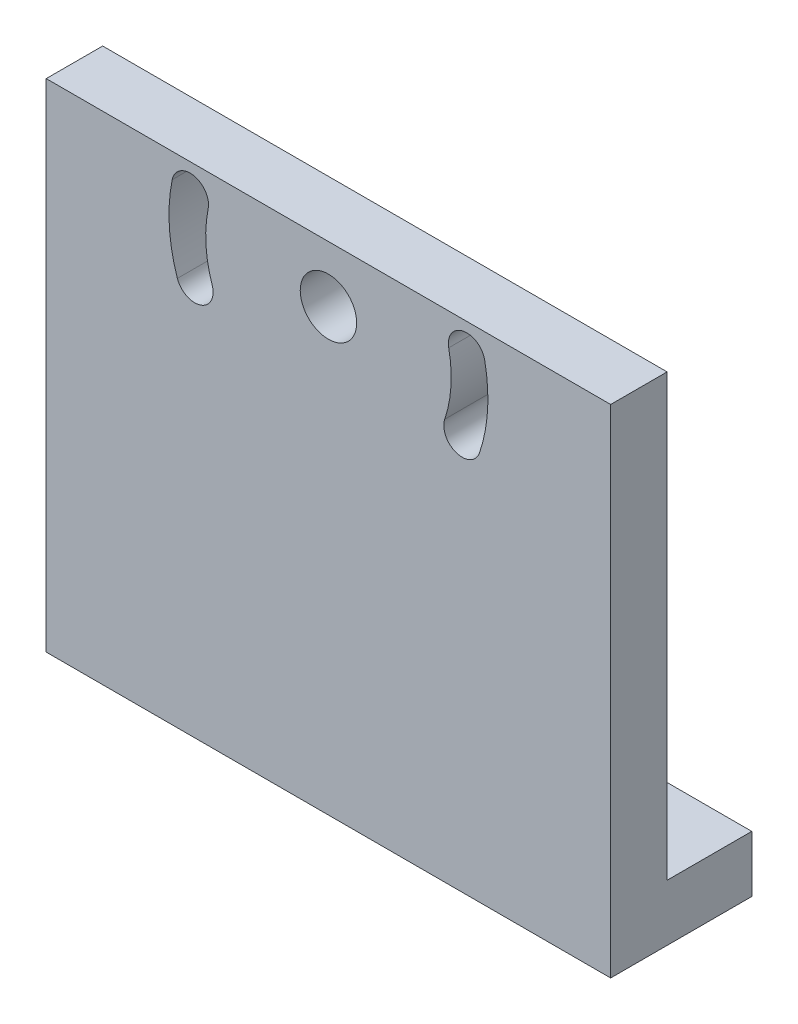
ISO-10303-21;
HEADER;
FILE_DESCRIPTION(('STEP AP214'),'2;1');
FILE_NAME('part.step','',(''),(''),'','','');
FILE_SCHEMA(('AUTOMOTIVE_DESIGN { 1 0 10303 214 1 1 1 1 }'));
ENDSEC;
DATA;
#1=APPLICATION_CONTEXT('core data for automotive mechanical design processes');
#2=APPLICATION_PROTOCOL_DEFINITION('international standard','automotive_design',2000,#1);
#3=PRODUCT_CONTEXT('',#1,'mechanical');
#4=PRODUCT('Part','Part','',(#3));
#5=PRODUCT_RELATED_PRODUCT_CATEGORY('part','',(#4));
#6=PRODUCT_DEFINITION_FORMATION('','',#4);
#7=PRODUCT_DEFINITION_CONTEXT('part definition',#1,'design');
#8=PRODUCT_DEFINITION('design','',#6,#7);
#9=PRODUCT_DEFINITION_SHAPE('','',#8);
#10=(LENGTH_UNIT() NAMED_UNIT(*) SI_UNIT(.MILLI.,.METRE.));
#11=(NAMED_UNIT(*) PLANE_ANGLE_UNIT() SI_UNIT($,.RADIAN.));
#12=(NAMED_UNIT(*) SI_UNIT($,.STERADIAN.) SOLID_ANGLE_UNIT());
#13=UNCERTAINTY_MEASURE_WITH_UNIT(LENGTH_MEASURE(1.E-05),#10,'distance_accuracy_value','');
#14=(GEOMETRIC_REPRESENTATION_CONTEXT(3) GLOBAL_UNCERTAINTY_ASSIGNED_CONTEXT((#13)) GLOBAL_UNIT_ASSIGNED_CONTEXT((#10,
#11,#12)) REPRESENTATION_CONTEXT('',''));
#15=CARTESIAN_POINT('',(0.,0.,0.));
#16=DIRECTION('',(0.,0.,1.));
#17=DIRECTION('',(1.,0.,0.));
#18=AXIS2_PLACEMENT_3D('',#15,#16,#17);
#19=CARTESIAN_POINT('',(0.,0.,0.));
#20=DIRECTION('',(0.,0.,-1.));
#21=DIRECTION('',(-1.,0.,0.));
#22=AXIS2_PLACEMENT_3D('',#19,#20,#21);
#23=PLANE('',#22);
#24=CARTESIAN_POINT('',(26.314561435346,25.,0.));
#25=DIRECTION('',(0.,0.,1.));
#26=DIRECTION('',(1.,0.,0.));
#27=AXIS2_PLACEMENT_3D('',#24,#25,#26);
#28=CIRCLE('',#27,3.25);
#29=CARTESIAN_POINT('',(23.235454421941,23.96,0.));
#30=VERTEX_POINT('',#29);
#31=CARTESIAN_POINT('',(29.393668448751,26.04,0.));
#32=VERTEX_POINT('',#31);
#33=EDGE_CURVE('E190',#30,#32,#28,.T.);
#34=ORIENTED_EDGE('',*,*,#33,.T.);
#35=CARTESIAN_POINT('',(50.,33.,0.));
#36=DIRECTION('',(0.,0.,-1.));
#37=DIRECTION('',(1.,0.,0.));
#38=AXIS2_PLACEMENT_3D('',#35,#36,#37);
#39=CIRCLE('',#38,21.75);
#40=CARTESIAN_POINT('',(28.6894392377864,37.35,0.));
#41=VERTEX_POINT('',#40);
#42=EDGE_CURVE('E176',#32,#41,#39,.T.);
#43=ORIENTED_EDGE('',*,*,#42,.T.);
#44=CARTESIAN_POINT('',(25.5051025721682,38.,0.));
#45=DIRECTION('',(0.,0.,1.));
#46=DIRECTION('',(1.,0.,0.));
#47=AXIS2_PLACEMENT_3D('',#44,#45,#46);
#48=CIRCLE('',#47,3.25000000000001);
#49=CARTESIAN_POINT('',(22.3207659065501,38.65,0.));
#50=VERTEX_POINT('',#49);
#51=EDGE_CURVE('E180',#41,#50,#48,.T.);
#52=ORIENTED_EDGE('',*,*,#51,.T.);
#53=CARTESIAN_POINT('',(50.,33.,0.));
#54=DIRECTION('',(0.,0.,1.));
#55=DIRECTION('',(1.,0.,0.));
#56=AXIS2_PLACEMENT_3D('',#53,#54,#55);
#57=CIRCLE('',#56,28.25);
#58=EDGE_CURVE('E193',#50,#30,#57,.T.);
#59=ORIENTED_EDGE('',*,*,#58,.T.);
#60=EDGE_LOOP('',(#34,#43,#52,#59));
#61=FACE_BOUND('',#60,.T.);
#62=CARTESIAN_POINT('',(50.,33.,0.));
#63=DIRECTION('',(0.,0.,1.));
#64=DIRECTION('',(-1.,0.,0.));
#65=AXIS2_PLACEMENT_3D('',#62,#63,#64);
#66=CIRCLE('',#65,21.75);
#67=CARTESIAN_POINT('',(70.606331551249,26.04,0.));
#68=VERTEX_POINT('',#67);
#69=CARTESIAN_POINT('',(71.3105607622137,37.35,0.));
#70=VERTEX_POINT('',#69);
#71=EDGE_CURVE('E201',#68,#70,#66,.T.);
#72=ORIENTED_EDGE('',*,*,#71,.F.);
#73=CARTESIAN_POINT('',(73.685438564654,25.,0.));
#74=DIRECTION('',(0.,0.,-1.));
#75=DIRECTION('',(-1.,0.,0.));
#76=AXIS2_PLACEMENT_3D('',#73,#74,#75);
#77=CIRCLE('',#76,3.25);
#78=CARTESIAN_POINT('',(76.7645455780591,23.96,0.));
#79=VERTEX_POINT('',#78);
#80=EDGE_CURVE('E212',#79,#68,#77,.T.);
#81=ORIENTED_EDGE('',*,*,#80,.F.);
#82=CARTESIAN_POINT('',(50.,33.,0.));
#83=DIRECTION('',(0.,0.,-1.));
#84=DIRECTION('',(-1.,0.,0.));
#85=AXIS2_PLACEMENT_3D('',#82,#83,#84);
#86=CIRCLE('',#85,28.25);
#87=CARTESIAN_POINT('',(77.6792340934499,38.65,0.));
#88=VERTEX_POINT('',#87);
#89=EDGE_CURVE('E226',#88,#79,#86,.T.);
#90=ORIENTED_EDGE('',*,*,#89,.F.);
#91=CARTESIAN_POINT('',(74.4948974278318,38.,0.));
#92=DIRECTION('',(0.,0.,-1.));
#93=DIRECTION('',(-1.,0.,0.));
#94=AXIS2_PLACEMENT_3D('',#91,#92,#93);
#95=CIRCLE('',#94,3.25000000000001);
#96=EDGE_CURVE('E223',#70,#88,#95,.T.);
#97=ORIENTED_EDGE('',*,*,#96,.F.);
#98=EDGE_LOOP('',(#72,#81,#90,#97));
#99=FACE_BOUND('',#98,.T.);
#100=CARTESIAN_POINT('',(50.,33.,0.));
#101=DIRECTION('',(0.,0.,-1.));
#102=DIRECTION('',(-1.,0.,0.));
#103=AXIS2_PLACEMENT_3D('',#100,#101,#102);
#104=CIRCLE('',#103,5.);
#105=CARTESIAN_POINT('',(45.,33.,0.));
#106=VERTEX_POINT('',#105);
#107=EDGE_CURVE('E233',#106,#106,#104,.T.);
#108=ORIENTED_EDGE('',*,*,#107,.F.);
#109=EDGE_LOOP('',(#108));
#110=FACE_BOUND('',#109,.T.);
#111=DIRECTION('',(0.,-1.,0.));
#112=VECTOR('',#111,1.);
#113=CARTESIAN_POINT('',(100.,103.,0.));
#114=LINE('',#113,#112);
#115=CARTESIAN_POINT('',(100.,43.,0.));
#116=VERTEX_POINT('',#115);
#117=CARTESIAN_POINT('',(100.,-35.,0.));
#118=VERTEX_POINT('',#117);
#119=EDGE_CURVE('E55',#116,#118,#114,.T.);
#120=ORIENTED_EDGE('',*,*,#119,.T.);
#121=DIRECTION('',(1.,0.,0.));
#122=VECTOR('',#121,1.);
#123=CARTESIAN_POINT('',(100.,-35.,0.));
#124=LINE('',#123,#122);
#125=CARTESIAN_POINT('',(0.,-35.,0.));
#126=VERTEX_POINT('',#125);
#127=EDGE_CURVE('E50',#126,#118,#124,.T.);
#128=ORIENTED_EDGE('',*,*,#127,.F.);
#129=DIRECTION('',(0.,-1.,0.));
#130=VECTOR('',#129,1.);
#131=CARTESIAN_POINT('',(0.,0.,0.));
#132=LINE('',#131,#130);
#133=CARTESIAN_POINT('',(0.,43.,0.));
#134=VERTEX_POINT('',#133);
#135=EDGE_CURVE('E253',#134,#126,#132,.T.);
#136=ORIENTED_EDGE('',*,*,#135,.F.);
#137=DIRECTION('',(1.,0.,0.));
#138=VECTOR('',#137,1.);
#139=CARTESIAN_POINT('',(0.,43.,0.));
#140=LINE('',#139,#138);
#141=EDGE_CURVE('E246',#134,#116,#140,.T.);
#142=ORIENTED_EDGE('',*,*,#141,.T.);
#143=EDGE_LOOP('',(#120,#128,#136,#142));
#144=FACE_BOUND('',#143,.T.);
#145=ADVANCED_FACE('F35',(#61,#99,#110,#144),#23,.T.);
#146=CARTESIAN_POINT('',(0.,0.,10.));
#147=DIRECTION('',(1.,0.,0.));
#148=DIRECTION('',(0.,0.,-1.));
#149=AXIS2_PLACEMENT_3D('',#146,#147,#148);
#150=PLANE('',#149);
#151=ORIENTED_EDGE('',*,*,#135,.T.);
#152=DIRECTION('',(0.,0.,1.));
#153=VECTOR('',#152,1.);
#154=CARTESIAN_POINT('',(0.,-35.,-15.));
#155=LINE('',#154,#153);
#156=CARTESIAN_POINT('',(0.,-35.,-15.));
#157=VERTEX_POINT('',#156);
#158=EDGE_CURVE('E156',#157,#126,#155,.T.);
#159=ORIENTED_EDGE('',*,*,#158,.F.);
#160=DIRECTION('',(0.,-1.,0.));
#161=VECTOR('',#160,1.);
#162=CARTESIAN_POINT('',(0.,-45.,-15.));
#163=LINE('',#162,#161);
#164=CARTESIAN_POINT('',(0.,-45.,-15.));
#165=VERTEX_POINT('',#164);
#166=EDGE_CURVE('E152',#157,#165,#163,.T.);
#167=ORIENTED_EDGE('',*,*,#166,.T.);
#168=DIRECTION('',(0.,0.,-1.));
#169=VECTOR('',#168,1.);
#170=CARTESIAN_POINT('',(0.,-45.,0.));
#171=LINE('',#170,#169);
#172=CARTESIAN_POINT('',(0.,-45.,10.));
#173=VERTEX_POINT('',#172);
#174=EDGE_CURVE('E174',#173,#165,#171,.T.);
#175=ORIENTED_EDGE('',*,*,#174,.F.);
#176=DIRECTION('',(0.,-1.,0.));
#177=VECTOR('',#176,1.);
#178=CARTESIAN_POINT('',(0.,0.,10.));
#179=LINE('',#178,#177);
#180=CARTESIAN_POINT('',(0.,43.,10.));
#181=VERTEX_POINT('',#180);
#182=EDGE_CURVE('E43',#181,#173,#179,.T.);
#183=ORIENTED_EDGE('',*,*,#182,.F.);
#184=DIRECTION('',(0.,0.,1.));
#185=VECTOR('',#184,1.);
#186=CARTESIAN_POINT('',(0.,43.,0.));
#187=LINE('',#186,#185);
#188=EDGE_CURVE('E248',#134,#181,#187,.T.);
#189=ORIENTED_EDGE('',*,*,#188,.F.);
#190=EDGE_LOOP('',(#151,#159,#167,#175,#183,#189));
#191=FACE_BOUND('',#190,.T.);
#192=ADVANCED_FACE('F37',(#191),#150,.F.);
#193=CARTESIAN_POINT('',(0.,0.,10.));
#194=DIRECTION('',(0.,0.,-1.));
#195=DIRECTION('',(-1.,0.,0.));
#196=AXIS2_PLACEMENT_3D('',#193,#194,#195);
#197=PLANE('',#196);
#198=CARTESIAN_POINT('',(50.,33.,10.));
#199=DIRECTION('',(0.,0.,-1.));
#200=DIRECTION('',(1.,0.,0.));
#201=AXIS2_PLACEMENT_3D('',#198,#199,#200);
#202=CIRCLE('',#201,21.75);
#203=CARTESIAN_POINT('',(29.393668448751,26.04,10.));
#204=VERTEX_POINT('',#203);
#205=CARTESIAN_POINT('',(28.6894392377864,37.35,10.));
#206=VERTEX_POINT('',#205);
#207=EDGE_CURVE('E177',#204,#206,#202,.T.);
#208=ORIENTED_EDGE('',*,*,#207,.F.);
#209=CARTESIAN_POINT('',(26.314561435346,25.,10.));
#210=DIRECTION('',(0.,0.,1.));
#211=DIRECTION('',(1.,0.,0.));
#212=AXIS2_PLACEMENT_3D('',#209,#210,#211);
#213=CIRCLE('',#212,3.25);
#214=CARTESIAN_POINT('',(23.235454421941,23.96,10.));
#215=VERTEX_POINT('',#214);
#216=EDGE_CURVE('E179',#215,#204,#213,.T.);
#217=ORIENTED_EDGE('',*,*,#216,.F.);
#218=CARTESIAN_POINT('',(50.,33.,10.));
#219=DIRECTION('',(0.,0.,1.));
#220=DIRECTION('',(1.,0.,0.));
#221=AXIS2_PLACEMENT_3D('',#218,#219,#220);
#222=CIRCLE('',#221,28.25);
#223=CARTESIAN_POINT('',(22.3207659065501,38.65,10.));
#224=VERTEX_POINT('',#223);
#225=EDGE_CURVE('E182',#224,#215,#222,.T.);
#226=ORIENTED_EDGE('',*,*,#225,.F.);
#227=CARTESIAN_POINT('',(25.5051025721682,38.,10.));
#228=DIRECTION('',(0.,0.,1.));
#229=DIRECTION('',(1.,0.,0.));
#230=AXIS2_PLACEMENT_3D('',#227,#228,#229);
#231=CIRCLE('',#230,3.25000000000001);
#232=EDGE_CURVE('E185',#206,#224,#231,.T.);
#233=ORIENTED_EDGE('',*,*,#232,.F.);
#234=EDGE_LOOP('',(#208,#217,#226,#233));
#235=FACE_BOUND('',#234,.T.);
#236=CARTESIAN_POINT('',(73.685438564654,25.,10.));
#237=DIRECTION('',(0.,0.,-1.));
#238=DIRECTION('',(-1.,0.,0.));
#239=AXIS2_PLACEMENT_3D('',#236,#237,#238);
#240=CIRCLE('',#239,3.25);
#241=CARTESIAN_POINT('',(76.7645455780591,23.96,10.));
#242=VERTEX_POINT('',#241);
#243=CARTESIAN_POINT('',(70.606331551249,26.04,10.));
#244=VERTEX_POINT('',#243);
#245=EDGE_CURVE('E218',#242,#244,#240,.T.);
#246=ORIENTED_EDGE('',*,*,#245,.T.);
#247=CARTESIAN_POINT('',(50.,33.,10.));
#248=DIRECTION('',(0.,0.,1.));
#249=DIRECTION('',(-1.,0.,0.));
#250=AXIS2_PLACEMENT_3D('',#247,#248,#249);
#251=CIRCLE('',#250,21.75);
#252=CARTESIAN_POINT('',(71.3105607622137,37.35,10.));
#253=VERTEX_POINT('',#252);
#254=EDGE_CURVE('E208',#244,#253,#251,.T.);
#255=ORIENTED_EDGE('',*,*,#254,.T.);
#256=CARTESIAN_POINT('',(74.4948974278318,38.,10.));
#257=DIRECTION('',(0.,0.,-1.));
#258=DIRECTION('',(-1.,0.,0.));
#259=AXIS2_PLACEMENT_3D('',#256,#257,#258);
#260=CIRCLE('',#259,3.25000000000001);
#261=CARTESIAN_POINT('',(77.6792340934499,38.65,10.));
#262=VERTEX_POINT('',#261);
#263=EDGE_CURVE('E211',#253,#262,#260,.T.);
#264=ORIENTED_EDGE('',*,*,#263,.T.);
#265=CARTESIAN_POINT('',(50.,33.,10.));
#266=DIRECTION('',(0.,0.,-1.));
#267=DIRECTION('',(-1.,0.,0.));
#268=AXIS2_PLACEMENT_3D('',#265,#266,#267);
#269=CIRCLE('',#268,28.25);
#270=EDGE_CURVE('E215',#262,#242,#269,.T.);
#271=ORIENTED_EDGE('',*,*,#270,.T.);
#272=EDGE_LOOP('',(#246,#255,#264,#271));
#273=FACE_BOUND('',#272,.T.);
#274=CARTESIAN_POINT('',(50.,33.,10.));
#275=DIRECTION('',(0.,0.,-1.));
#276=DIRECTION('',(-1.,0.,0.));
#277=AXIS2_PLACEMENT_3D('',#274,#275,#276);
#278=CIRCLE('',#277,5.);
#279=CARTESIAN_POINT('',(45.,33.,10.));
#280=VERTEX_POINT('',#279);
#281=EDGE_CURVE('E240',#280,#280,#278,.T.);
#282=ORIENTED_EDGE('',*,*,#281,.T.);
#283=EDGE_LOOP('',(#282));
#284=FACE_BOUND('',#283,.T.);
#285=ORIENTED_EDGE('',*,*,#182,.T.);
#286=DIRECTION('',(-1.,0.,0.));
#287=VECTOR('',#286,1.);
#288=CARTESIAN_POINT('',(100.,-45.,10.));
#289=LINE('',#288,#287);
#290=CARTESIAN_POINT('',(100.,-45.,10.));
#291=VERTEX_POINT('',#290);
#292=EDGE_CURVE('E171',#291,#173,#289,.T.);
#293=ORIENTED_EDGE('',*,*,#292,.F.);
#294=DIRECTION('',(0.,-1.,0.));
#295=VECTOR('',#294,1.);
#296=CARTESIAN_POINT('',(100.,103.,10.));
#297=LINE('',#296,#295);
#298=CARTESIAN_POINT('',(100.,43.,10.));
#299=VERTEX_POINT('',#298);
#300=EDGE_CURVE('E251',#299,#291,#297,.T.);
#301=ORIENTED_EDGE('',*,*,#300,.F.);
#302=DIRECTION('',(1.,0.,0.));
#303=VECTOR('',#302,1.);
#304=CARTESIAN_POINT('',(0.,43.,10.));
#305=LINE('',#304,#303);
#306=EDGE_CURVE('E243',#181,#299,#305,.T.);
#307=ORIENTED_EDGE('',*,*,#306,.F.);
#308=EDGE_LOOP('',(#285,#293,#301,#307));
#309=FACE_BOUND('',#308,.T.);
#310=ADVANCED_FACE('F263',(#235,#273,#284,#309),#197,.F.);
#311=CARTESIAN_POINT('',(100.,103.,0.));
#312=DIRECTION('',(-1.,0.,0.));
#313=DIRECTION('',(0.,-1.,0.));
#314=AXIS2_PLACEMENT_3D('',#311,#312,#313);
#315=PLANE('',#314);
#316=ORIENTED_EDGE('',*,*,#300,.T.);
#317=DIRECTION('',(0.,0.,1.));
#318=VECTOR('',#317,1.);
#319=CARTESIAN_POINT('',(100.,-45.,0.));
#320=LINE('',#319,#318);
#321=CARTESIAN_POINT('',(100.,-45.,-15.));
#322=VERTEX_POINT('',#321);
#323=EDGE_CURVE('E142',#322,#291,#320,.T.);
#324=ORIENTED_EDGE('',*,*,#323,.F.);
#325=DIRECTION('',(0.,1.,0.));
#326=VECTOR('',#325,1.);
#327=CARTESIAN_POINT('',(100.,-45.,-15.));
#328=LINE('',#327,#326);
#329=CARTESIAN_POINT('',(100.,-35.,-15.));
#330=VERTEX_POINT('',#329);
#331=EDGE_CURVE('E136',#322,#330,#328,.T.);
#332=ORIENTED_EDGE('',*,*,#331,.T.);
#333=DIRECTION('',(0.,0.,-1.));
#334=VECTOR('',#333,1.);
#335=CARTESIAN_POINT('',(100.,-35.,-15.));
#336=LINE('',#335,#334);
#337=EDGE_CURVE('E140',#118,#330,#336,.T.);
#338=ORIENTED_EDGE('',*,*,#337,.F.);
#339=ORIENTED_EDGE('',*,*,#119,.F.);
#340=DIRECTION('',(0.,0.,1.));
#341=VECTOR('',#340,1.);
#342=CARTESIAN_POINT('',(100.,43.,0.));
#343=LINE('',#342,#341);
#344=EDGE_CURVE('E11',#116,#299,#343,.T.);
#345=ORIENTED_EDGE('',*,*,#344,.T.);
#346=EDGE_LOOP('',(#316,#324,#332,#338,#339,#345));
#347=FACE_BOUND('',#346,.T.);
#348=ADVANCED_FACE('F138',(#347),#315,.F.);
#349=CARTESIAN_POINT('',(0.,43.,0.));
#350=DIRECTION('',(0.,-1.,0.));
#351=DIRECTION('',(0.,0.,-1.));
#352=AXIS2_PLACEMENT_3D('',#349,#350,#351);
#353=PLANE('',#352);
#354=ORIENTED_EDGE('',*,*,#141,.F.);
#355=ORIENTED_EDGE('',*,*,#188,.T.);
#356=ORIENTED_EDGE('',*,*,#306,.T.);
#357=ORIENTED_EDGE('',*,*,#344,.F.);
#358=EDGE_LOOP('',(#354,#355,#356,#357));
#359=FACE_BOUND('',#358,.T.);
#360=ADVANCED_FACE('F298',(#359),#353,.F.);
#361=CARTESIAN_POINT('',(50.,33.,10.));
#362=DIRECTION('',(0.,0.,-1.));
#363=DIRECTION('',(-1.,0.,0.));
#364=AXIS2_PLACEMENT_3D('',#361,#362,#363);
#365=CYLINDRICAL_SURFACE('',#364,5.);
#366=ORIENTED_EDGE('',*,*,#281,.F.);
#367=EDGE_LOOP('',(#366));
#368=FACE_BOUND('',#367,.T.);
#369=ORIENTED_EDGE('',*,*,#107,.T.);
#370=EDGE_LOOP('',(#369));
#371=FACE_BOUND('',#370,.T.);
#372=ADVANCED_FACE('F301',(#368,#371),#365,.F.);
#373=CARTESIAN_POINT('',(50.,33.,10.));
#374=DIRECTION('',(0.,0.,-1.));
#375=DIRECTION('',(-1.,0.,0.));
#376=AXIS2_PLACEMENT_3D('',#373,#374,#375);
#377=CYLINDRICAL_SURFACE('',#376,21.75);
#378=ORIENTED_EDGE('',*,*,#71,.T.);
#379=DIRECTION('',(0.,0.,-1.));
#380=VECTOR('',#379,1.);
#381=CARTESIAN_POINT('',(71.3105607622137,37.35,10.));
#382=LINE('',#381,#380);
#383=EDGE_CURVE('E221',#253,#70,#382,.T.);
#384=ORIENTED_EDGE('',*,*,#383,.F.);
#385=ORIENTED_EDGE('',*,*,#254,.F.);
#386=DIRECTION('',(0.,0.,-1.));
#387=VECTOR('',#386,1.);
#388=CARTESIAN_POINT('',(70.606331551249,26.04,10.));
#389=LINE('',#388,#387);
#390=EDGE_CURVE('E231',#244,#68,#389,.T.);
#391=ORIENTED_EDGE('',*,*,#390,.T.);
#392=EDGE_LOOP('',(#378,#384,#385,#391));
#393=FACE_BOUND('',#392,.T.);
#394=ADVANCED_FACE('F304',(#393),#377,.T.);
#395=CARTESIAN_POINT('',(73.685438564654,25.,10.));
#396=DIRECTION('',(0.,0.,-1.));
#397=DIRECTION('',(-1.,0.,0.));
#398=AXIS2_PLACEMENT_3D('',#395,#396,#397);
#399=CYLINDRICAL_SURFACE('',#398,3.25);
#400=ORIENTED_EDGE('',*,*,#80,.T.);
#401=ORIENTED_EDGE('',*,*,#390,.F.);
#402=ORIENTED_EDGE('',*,*,#245,.F.);
#403=DIRECTION('',(0.,0.,-1.));
#404=VECTOR('',#403,1.);
#405=CARTESIAN_POINT('',(76.7645455780591,23.96,10.));
#406=LINE('',#405,#404);
#407=EDGE_CURVE('E234',#242,#79,#406,.T.);
#408=ORIENTED_EDGE('',*,*,#407,.T.);
#409=EDGE_LOOP('',(#400,#401,#402,#408));
#410=FACE_BOUND('',#409,.T.);
#411=ADVANCED_FACE('F308',(#410),#399,.F.);
#412=CARTESIAN_POINT('',(50.,33.,10.));
#413=DIRECTION('',(0.,0.,-1.));
#414=DIRECTION('',(-1.,0.,0.));
#415=AXIS2_PLACEMENT_3D('',#412,#413,#414);
#416=CYLINDRICAL_SURFACE('',#415,28.25);
#417=ORIENTED_EDGE('',*,*,#89,.T.);
#418=ORIENTED_EDGE('',*,*,#407,.F.);
#419=ORIENTED_EDGE('',*,*,#270,.F.);
#420=DIRECTION('',(0.,0.,-1.));
#421=VECTOR('',#420,1.);
#422=CARTESIAN_POINT('',(77.6792340934499,38.65,10.));
#423=LINE('',#422,#421);
#424=EDGE_CURVE('E236',#262,#88,#423,.T.);
#425=ORIENTED_EDGE('',*,*,#424,.T.);
#426=EDGE_LOOP('',(#417,#418,#419,#425));
#427=FACE_BOUND('',#426,.T.);
#428=ADVANCED_FACE('F314',(#427),#416,.F.);
#429=CARTESIAN_POINT('',(74.4948974278318,38.,10.));
#430=DIRECTION('',(0.,0.,-1.));
#431=DIRECTION('',(-1.,0.,0.));
#432=AXIS2_PLACEMENT_3D('',#429,#430,#431);
#433=CYLINDRICAL_SURFACE('',#432,3.25000000000001);
#434=ORIENTED_EDGE('',*,*,#96,.T.);
#435=ORIENTED_EDGE('',*,*,#424,.F.);
#436=ORIENTED_EDGE('',*,*,#263,.F.);
#437=ORIENTED_EDGE('',*,*,#383,.T.);
#438=EDGE_LOOP('',(#434,#435,#436,#437));
#439=FACE_BOUND('',#438,.T.);
#440=ADVANCED_FACE('F310',(#439),#433,.F.);
#441=CARTESIAN_POINT('',(50.,33.,10.));
#442=DIRECTION('',(0.,0.,-1.));
#443=DIRECTION('',(-1.,0.,0.));
#444=AXIS2_PLACEMENT_3D('',#441,#442,#443);
#445=CYLINDRICAL_SURFACE('',#444,21.75);
#446=ORIENTED_EDGE('',*,*,#42,.F.);
#447=DIRECTION('',(0.,0.,-1.));
#448=VECTOR('',#447,1.);
#449=CARTESIAN_POINT('',(29.393668448751,26.04,10.));
#450=LINE('',#449,#448);
#451=EDGE_CURVE('E187',#204,#32,#450,.T.);
#452=ORIENTED_EDGE('',*,*,#451,.F.);
#453=ORIENTED_EDGE('',*,*,#207,.T.);
#454=DIRECTION('',(0.,0.,-1.));
#455=VECTOR('',#454,1.);
#456=CARTESIAN_POINT('',(28.6894392377864,37.35,10.));
#457=LINE('',#456,#455);
#458=EDGE_CURVE('E198',#206,#41,#457,.T.);
#459=ORIENTED_EDGE('',*,*,#458,.T.);
#460=EDGE_LOOP('',(#446,#452,#453,#459));
#461=FACE_BOUND('',#460,.T.);
#462=ADVANCED_FACE('F313',(#461),#445,.T.);
#463=CARTESIAN_POINT('',(25.5051025721682,38.,10.));
#464=DIRECTION('',(0.,0.,-1.));
#465=DIRECTION('',(-1.,0.,0.));
#466=AXIS2_PLACEMENT_3D('',#463,#464,#465);
#467=CYLINDRICAL_SURFACE('',#466,3.25000000000001);
#468=ORIENTED_EDGE('',*,*,#51,.F.);
#469=ORIENTED_EDGE('',*,*,#458,.F.);
#470=ORIENTED_EDGE('',*,*,#232,.T.);
#471=DIRECTION('',(0.,0.,-1.));
#472=VECTOR('',#471,1.);
#473=CARTESIAN_POINT('',(22.3207659065501,38.65,10.));
#474=LINE('',#473,#472);
#475=EDGE_CURVE('E202',#224,#50,#474,.T.);
#476=ORIENTED_EDGE('',*,*,#475,.T.);
#477=EDGE_LOOP('',(#468,#469,#470,#476));
#478=FACE_BOUND('',#477,.T.);
#479=ADVANCED_FACE('F323',(#478),#467,.F.);
#480=CARTESIAN_POINT('',(50.,33.,10.));
#481=DIRECTION('',(0.,0.,-1.));
#482=DIRECTION('',(-1.,0.,0.));
#483=AXIS2_PLACEMENT_3D('',#480,#481,#482);
#484=CYLINDRICAL_SURFACE('',#483,28.25);
#485=ORIENTED_EDGE('',*,*,#58,.F.);
#486=ORIENTED_EDGE('',*,*,#475,.F.);
#487=ORIENTED_EDGE('',*,*,#225,.T.);
#488=DIRECTION('',(0.,0.,-1.));
#489=VECTOR('',#488,1.);
#490=CARTESIAN_POINT('',(23.235454421941,23.96,10.));
#491=LINE('',#490,#489);
#492=EDGE_CURVE('E204',#215,#30,#491,.T.);
#493=ORIENTED_EDGE('',*,*,#492,.T.);
#494=EDGE_LOOP('',(#485,#486,#487,#493));
#495=FACE_BOUND('',#494,.T.);
#496=ADVANCED_FACE('F278',(#495),#484,.F.);
#497=CARTESIAN_POINT('',(26.314561435346,25.,10.));
#498=DIRECTION('',(0.,0.,-1.));
#499=DIRECTION('',(-1.,0.,0.));
#500=AXIS2_PLACEMENT_3D('',#497,#498,#499);
#501=CYLINDRICAL_SURFACE('',#500,3.25);
#502=ORIENTED_EDGE('',*,*,#33,.F.);
#503=ORIENTED_EDGE('',*,*,#492,.F.);
#504=ORIENTED_EDGE('',*,*,#216,.T.);
#505=ORIENTED_EDGE('',*,*,#451,.T.);
#506=EDGE_LOOP('',(#502,#503,#504,#505));
#507=FACE_BOUND('',#506,.T.);
#508=ADVANCED_FACE('F268',(#507),#501,.F.);
#509=CARTESIAN_POINT('',(0.,-45.,0.));
#510=DIRECTION('',(0.,-1.,0.));
#511=DIRECTION('',(0.,0.,-1.));
#512=AXIS2_PLACEMENT_3D('',#509,#510,#511);
#513=PLANE('',#512);
#514=CARTESIAN_POINT('',(17.5,-45.,-6.88525049409349));
#515=DIRECTION('',(0.,1.,0.));
#516=DIRECTION('',(0.,0.,-1.));
#517=AXIS2_PLACEMENT_3D('',#514,#515,#516);
#518=CIRCLE('',#517,2.75000000000001);
#519=CARTESIAN_POINT('',(17.5,-45.,-9.6352504940935));
#520=VERTEX_POINT('',#519);
#521=EDGE_CURVE('E423',#520,#520,#518,.T.);
#522=ORIENTED_EDGE('',*,*,#521,.T.);
#523=EDGE_LOOP('',(#522));
#524=FACE_BOUND('',#523,.T.);
#525=CARTESIAN_POINT('',(82.5,-45.,-6.88525049409349));
#526=DIRECTION('',(0.,1.,0.));
#527=DIRECTION('',(0.,0.,1.));
#528=AXIS2_PLACEMENT_3D('',#525,#526,#527);
#529=CIRCLE('',#528,2.75000000000001);
#530=CARTESIAN_POINT('',(82.5,-45.,-4.13525049409349));
#531=VERTEX_POINT('',#530);
#532=EDGE_CURVE('E159',#531,#531,#529,.T.);
#533=ORIENTED_EDGE('',*,*,#532,.T.);
#534=EDGE_LOOP('',(#533));
#535=FACE_BOUND('',#534,.T.);
#536=ORIENTED_EDGE('',*,*,#323,.T.);
#537=ORIENTED_EDGE('',*,*,#292,.T.);
#538=ORIENTED_EDGE('',*,*,#174,.T.);
#539=DIRECTION('',(1.,0.,0.));
#540=VECTOR('',#539,1.);
#541=CARTESIAN_POINT('',(0.,-45.,-15.));
#542=LINE('',#541,#540);
#543=EDGE_CURVE('E146',#165,#322,#542,.T.);
#544=ORIENTED_EDGE('',*,*,#543,.T.);
#545=EDGE_LOOP('',(#536,#537,#538,#544));
#546=FACE_BOUND('',#545,.T.);
#547=ADVANCED_FACE('F266',(#524,#535,#546),#513,.T.);
#548=CARTESIAN_POINT('',(0.,0.,-15.));
#549=DIRECTION('',(0.,0.,-1.));
#550=DIRECTION('',(-1.,0.,0.));
#551=AXIS2_PLACEMENT_3D('',#548,#549,#550);
#552=PLANE('',#551);
#553=ORIENTED_EDGE('',*,*,#166,.F.);
#554=DIRECTION('',(-1.,0.,0.));
#555=VECTOR('',#554,1.);
#556=CARTESIAN_POINT('',(100.,-35.,-15.));
#557=LINE('',#556,#555);
#558=EDGE_CURVE('E149',#330,#157,#557,.T.);
#559=ORIENTED_EDGE('',*,*,#558,.F.);
#560=ORIENTED_EDGE('',*,*,#331,.F.);
#561=ORIENTED_EDGE('',*,*,#543,.F.);
#562=EDGE_LOOP('',(#553,#559,#560,#561));
#563=FACE_BOUND('',#562,.T.);
#564=ADVANCED_FACE('F150',(#563),#552,.T.);
#565=CARTESIAN_POINT('',(0.,-35.,0.));
#566=DIRECTION('',(0.,-1.,0.));
#567=DIRECTION('',(0.,0.,-1.));
#568=AXIS2_PLACEMENT_3D('',#565,#566,#567);
#569=PLANE('',#568);
#570=CARTESIAN_POINT('',(17.5,-35.,-6.88525049409349));
#571=DIRECTION('',(0.,1.,0.));
#572=DIRECTION('',(0.,0.,-1.));
#573=AXIS2_PLACEMENT_3D('',#570,#571,#572);
#574=CIRCLE('',#573,2.75000000000001);
#575=CARTESIAN_POINT('',(17.5,-35.,-9.6352504940935));
#576=VERTEX_POINT('',#575);
#577=EDGE_CURVE('E426',#576,#576,#574,.T.);
#578=ORIENTED_EDGE('',*,*,#577,.F.);
#579=EDGE_LOOP('',(#578));
#580=FACE_BOUND('',#579,.T.);
#581=CARTESIAN_POINT('',(82.5,-35.,-6.88525049409349));
#582=DIRECTION('',(0.,1.,0.));
#583=DIRECTION('',(0.,0.,1.));
#584=AXIS2_PLACEMENT_3D('',#581,#582,#583);
#585=CIRCLE('',#584,2.75000000000001);
#586=CARTESIAN_POINT('',(82.5,-35.,-4.13525049409349));
#587=VERTEX_POINT('',#586);
#588=EDGE_CURVE('E162',#587,#587,#585,.T.);
#589=ORIENTED_EDGE('',*,*,#588,.F.);
#590=EDGE_LOOP('',(#589));
#591=FACE_BOUND('',#590,.T.);
#592=ORIENTED_EDGE('',*,*,#337,.T.);
#593=ORIENTED_EDGE('',*,*,#558,.T.);
#594=ORIENTED_EDGE('',*,*,#158,.T.);
#595=ORIENTED_EDGE('',*,*,#127,.T.);
#596=EDGE_LOOP('',(#592,#593,#594,#595));
#597=FACE_BOUND('',#596,.T.);
#598=ADVANCED_FACE('F158',(#580,#591,#597),#569,.F.);
#599=CARTESIAN_POINT('',(82.5,-45.,-6.88525049409349));
#600=DIRECTION('',(0.,1.,0.));
#601=DIRECTION('',(0.,0.,1.));
#602=AXIS2_PLACEMENT_3D('',#599,#600,#601);
#603=CYLINDRICAL_SURFACE('',#602,2.75000000000001);
#604=ORIENTED_EDGE('',*,*,#532,.F.);
#605=EDGE_LOOP('',(#604));
#606=FACE_BOUND('',#605,.T.);
#607=ORIENTED_EDGE('',*,*,#588,.T.);
#608=EDGE_LOOP('',(#607));
#609=FACE_BOUND('',#608,.T.);
#610=ADVANCED_FACE('F397',(#606,#609),#603,.F.);
#611=CARTESIAN_POINT('',(17.5,-45.,-6.88525049409349));
#612=DIRECTION('',(0.,1.,0.));
#613=DIRECTION('',(0.,0.,1.));
#614=AXIS2_PLACEMENT_3D('',#611,#612,#613);
#615=CYLINDRICAL_SURFACE('',#614,2.75000000000001);
#616=ORIENTED_EDGE('',*,*,#521,.F.);
#617=EDGE_LOOP('',(#616));
#618=FACE_BOUND('',#617,.T.);
#619=ORIENTED_EDGE('',*,*,#577,.T.);
#620=EDGE_LOOP('',(#619));
#621=FACE_BOUND('',#620,.T.);
#622=ADVANCED_FACE('F407',(#618,#621),#615,.F.);
#623=CLOSED_SHELL('',(#145,#192,#310,#348,#360,#372,#394,#411,#428,#440,#462,#479,#496,#508,
#547,#564,#598,#610,#622));
#624=MANIFOLD_SOLID_BREP('B2',#623);
#625=ADVANCED_BREP_SHAPE_REPRESENTATION('',(#18,#624),#14);
#626=SHAPE_DEFINITION_REPRESENTATION(#9,#625);
ENDSEC;
END-ISO-10303-21;
